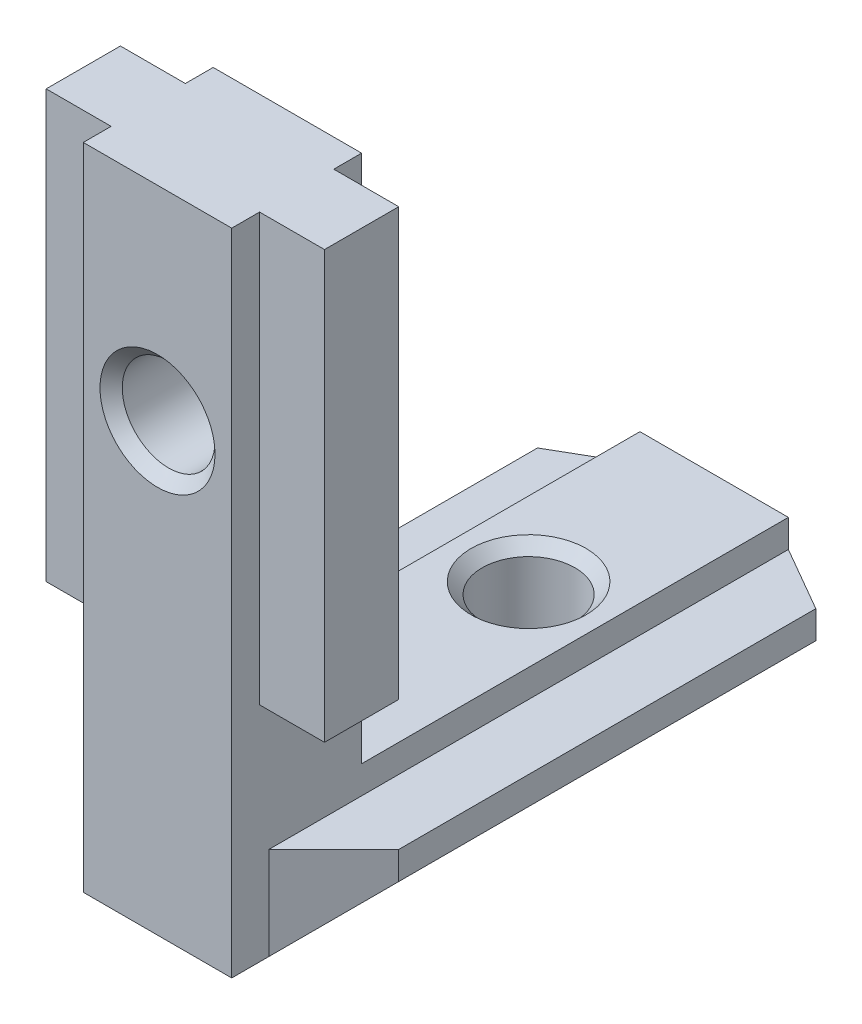
ISO-10303-21;
HEADER;
FILE_DESCRIPTION(('STEP AP214'),'2;1');
FILE_NAME('part.step','',(''),(''),'','','');
FILE_SCHEMA(('AUTOMOTIVE_DESIGN { 1 0 10303 214 1 1 1 1 }'));
ENDSEC;
DATA;
#1=APPLICATION_CONTEXT('core data for automotive mechanical design processes');
#2=APPLICATION_PROTOCOL_DEFINITION('international standard','automotive_design',2000,#1);
#3=PRODUCT_CONTEXT('',#1,'mechanical');
#4=PRODUCT('Part','Part','',(#3));
#5=PRODUCT_RELATED_PRODUCT_CATEGORY('part','',(#4));
#6=PRODUCT_DEFINITION_FORMATION('','',#4);
#7=PRODUCT_DEFINITION_CONTEXT('part definition',#1,'design');
#8=PRODUCT_DEFINITION('design','',#6,#7);
#9=PRODUCT_DEFINITION_SHAPE('','',#8);
#10=(LENGTH_UNIT() NAMED_UNIT(*) SI_UNIT(.MILLI.,.METRE.));
#11=(NAMED_UNIT(*) PLANE_ANGLE_UNIT() SI_UNIT($,.RADIAN.));
#12=(NAMED_UNIT(*) SI_UNIT($,.STERADIAN.) SOLID_ANGLE_UNIT());
#13=UNCERTAINTY_MEASURE_WITH_UNIT(LENGTH_MEASURE(1.E-05),#10,'distance_accuracy_value','');
#14=(GEOMETRIC_REPRESENTATION_CONTEXT(3) GLOBAL_UNCERTAINTY_ASSIGNED_CONTEXT((#13)) GLOBAL_UNIT_ASSIGNED_CONTEXT((#10,
#11,#12)) REPRESENTATION_CONTEXT('',''));
#15=CARTESIAN_POINT('',(0.,0.,0.));
#16=DIRECTION('',(0.,0.,1.));
#17=DIRECTION('',(1.,0.,0.));
#18=AXIS2_PLACEMENT_3D('',#15,#16,#17);
#19=CARTESIAN_POINT('',(4.,0.,30.));
#20=DIRECTION('',(0.,-1.,0.));
#21=DIRECTION('',(0.,0.,-1.));
#22=AXIS2_PLACEMENT_3D('',#19,#20,#21);
#23=PLANE('',#22);
#24=CARTESIAN_POINT('',(0.,0.,10.));
#25=DIRECTION('',(0.,-1.,0.));
#26=DIRECTION('',(0.,0.,-1.));
#27=AXIS2_PLACEMENT_3D('',#24,#25,#26);
#28=CIRCLE('',#27,3.1);
#29=CARTESIAN_POINT('',(0.,0.,6.9));
#30=VERTEX_POINT('',#29);
#31=EDGE_CURVE('E672',#30,#30,#28,.T.);
#32=ORIENTED_EDGE('',*,*,#31,.T.);
#33=EDGE_LOOP('',(#32));
#34=FACE_BOUND('',#33,.T.);
#35=DIRECTION('',(-1.,0.,0.));
#36=VECTOR('',#35,1.);
#37=CARTESIAN_POINT('',(4.,0.,23.));
#38=LINE('',#37,#36);
#39=CARTESIAN_POINT('',(4.,0.,23.));
#40=VERTEX_POINT('',#39);
#41=CARTESIAN_POINT('',(-4.,0.,23.));
#42=VERTEX_POINT('',#41);
#43=EDGE_CURVE('E341',#40,#42,#38,.T.);
#44=ORIENTED_EDGE('',*,*,#43,.F.);
#45=DIRECTION('',(0.,0.,-1.));
#46=VECTOR('',#45,1.);
#47=CARTESIAN_POINT('',(4.,0.,30.));
#48=LINE('',#47,#46);
#49=CARTESIAN_POINT('',(4.,0.,0.));
#50=VERTEX_POINT('',#49);
#51=EDGE_CURVE('E313',#40,#50,#48,.T.);
#52=ORIENTED_EDGE('',*,*,#51,.T.);
#53=DIRECTION('',(-1.,0.,0.));
#54=VECTOR('',#53,1.);
#55=CARTESIAN_POINT('',(4.,0.,0.));
#56=LINE('',#55,#54);
#57=CARTESIAN_POINT('',(-4.,0.,0.));
#58=VERTEX_POINT('',#57);
#59=EDGE_CURVE('E295',#50,#58,#56,.T.);
#60=ORIENTED_EDGE('',*,*,#59,.T.);
#61=DIRECTION('',(0.,0.,-1.));
#62=VECTOR('',#61,1.);
#63=CARTESIAN_POINT('',(-4.,0.,30.));
#64=LINE('',#63,#62);
#65=EDGE_CURVE('E301',#42,#58,#64,.T.);
#66=ORIENTED_EDGE('',*,*,#65,.F.);
#67=EDGE_LOOP('',(#44,#52,#60,#66));
#68=FACE_BOUND('',#67,.T.);
#69=ADVANCED_FACE('F36',(#34,#68),#23,.F.);
#70=CARTESIAN_POINT('',(-4.,0.,30.));
#71=DIRECTION('',(1.,0.,0.));
#72=DIRECTION('',(0.,0.,-1.));
#73=AXIS2_PLACEMENT_3D('',#70,#71,#72);
#74=PLANE('',#73);
#75=DIRECTION('',(0.,0.,1.));
#76=VECTOR('',#75,1.);
#77=CARTESIAN_POINT('',(-4.,28.5,30.));
#78=LINE('',#77,#76);
#79=CARTESIAN_POINT('',(-4.,28.5,28.5));
#80=VERTEX_POINT('',#79);
#81=CARTESIAN_POINT('',(-4.,28.5,30.));
#82=VERTEX_POINT('',#81);
#83=EDGE_CURVE('E283',#80,#82,#78,.T.);
#84=ORIENTED_EDGE('',*,*,#83,.F.);
#85=DIRECTION('',(0.,-1.,0.));
#86=VECTOR('',#85,1.);
#87=CARTESIAN_POINT('',(-4.,0.,28.5));
#88=LINE('',#87,#86);
#89=CARTESIAN_POINT('',(-4.,5.50000000000001,28.5));
#90=VERTEX_POINT('',#89);
#91=EDGE_CURVE('E232',#80,#90,#88,.T.);
#92=ORIENTED_EDGE('',*,*,#91,.T.);
#93=DIRECTION('',(0.,0.,1.));
#94=VECTOR('',#93,1.);
#95=CARTESIAN_POINT('',(-4.,5.50000000000001,30.));
#96=LINE('',#95,#94);
#97=CARTESIAN_POINT('',(-4.,5.50000000000001,24.5));
#98=VERTEX_POINT('',#97);
#99=EDGE_CURVE('E235',#98,#90,#96,.T.);
#100=ORIENTED_EDGE('',*,*,#99,.F.);
#101=DIRECTION('',(0.,1.,0.));
#102=VECTOR('',#101,1.);
#103=CARTESIAN_POINT('',(-4.,0.,24.5));
#104=LINE('',#103,#102);
#105=CARTESIAN_POINT('',(-4.,28.5,24.5));
#106=VERTEX_POINT('',#105);
#107=EDGE_CURVE('E227',#98,#106,#104,.T.);
#108=ORIENTED_EDGE('',*,*,#107,.T.);
#109=CARTESIAN_POINT('',(-4.,28.5,23.));
#110=VERTEX_POINT('',#109);
#111=EDGE_CURVE('E278',#110,#106,#78,.T.);
#112=ORIENTED_EDGE('',*,*,#111,.F.);
#113=DIRECTION('',(0.,1.,0.));
#114=VECTOR('',#113,1.);
#115=CARTESIAN_POINT('',(-4.,28.5,23.));
#116=LINE('',#115,#114);
#117=EDGE_CURVE('E274',#42,#110,#116,.T.);
#118=ORIENTED_EDGE('',*,*,#117,.F.);
#119=ORIENTED_EDGE('',*,*,#65,.T.);
#120=DIRECTION('',(0.,-1.,0.));
#121=VECTOR('',#120,1.);
#122=CARTESIAN_POINT('',(-4.,0.,0.));
#123=LINE('',#122,#121);
#124=CARTESIAN_POINT('',(-4.,-1.5,0.));
#125=VERTEX_POINT('',#124);
#126=EDGE_CURVE('E291',#58,#125,#123,.T.);
#127=ORIENTED_EDGE('',*,*,#126,.T.);
#128=DIRECTION('',(0.,0.,-1.));
#129=VECTOR('',#128,1.);
#130=CARTESIAN_POINT('',(-4.,-1.5,30.));
#131=LINE('',#130,#129);
#132=CARTESIAN_POINT('',(-4.,-1.5,28.));
#133=VERTEX_POINT('',#132);
#134=EDGE_CURVE('E338',#133,#125,#131,.T.);
#135=ORIENTED_EDGE('',*,*,#134,.F.);
#136=DIRECTION('',(0.,1.,0.));
#137=VECTOR('',#136,1.);
#138=CARTESIAN_POINT('',(-4.,-6.5,28.));
#139=LINE('',#138,#137);
#140=CARTESIAN_POINT('',(-4.,-6.5,28.));
#141=VERTEX_POINT('',#140);
#142=EDGE_CURVE('E240',#141,#133,#139,.T.);
#143=ORIENTED_EDGE('',*,*,#142,.F.);
#144=DIRECTION('',(0.,0.,-1.));
#145=VECTOR('',#144,1.);
#146=CARTESIAN_POINT('',(-4.,-6.5,30.));
#147=LINE('',#146,#145);
#148=CARTESIAN_POINT('',(-4.,-6.5,30.));
#149=VERTEX_POINT('',#148);
#150=EDGE_CURVE('E329',#149,#141,#147,.T.);
#151=ORIENTED_EDGE('',*,*,#150,.F.);
#152=DIRECTION('',(0.,-1.,0.));
#153=VECTOR('',#152,1.);
#154=CARTESIAN_POINT('',(-4.,0.,30.));
#155=LINE('',#154,#153);
#156=EDGE_CURVE('E292',#82,#149,#155,.T.);
#157=ORIENTED_EDGE('',*,*,#156,.F.);
#158=EDGE_LOOP('',(#84,#92,#100,#108,#112,#118,#119,#127,#135,#143,#151,#157));
#159=FACE_BOUND('',#158,.T.);
#160=ADVANCED_FACE('F38',(#159),#74,.F.);
#161=CARTESIAN_POINT('',(-4.,-1.5,30.));
#162=DIRECTION('',(0.,-1.,0.));
#163=DIRECTION('',(1.,0.,0.));
#164=AXIS2_PLACEMENT_3D('',#161,#162,#163);
#165=PLANE('',#164);
#166=DIRECTION('',(0.,0.,-1.));
#167=VECTOR('',#166,1.);
#168=CARTESIAN_POINT('',(-7.5,-1.5,30.));
#169=LINE('',#168,#167);
#170=CARTESIAN_POINT('',(-7.5,-1.5,24.5));
#171=VERTEX_POINT('',#170);
#172=CARTESIAN_POINT('',(-7.5,-1.5,2.02072594216366));
#173=VERTEX_POINT('',#172);
#174=EDGE_CURVE('E335',#171,#173,#169,.T.);
#175=ORIENTED_EDGE('',*,*,#174,.F.);
#176=DIRECTION('',(-0.707106781186549,0.,-0.707106781186546));
#177=VECTOR('',#176,1.);
#178=CARTESIAN_POINT('',(-4.,-1.5,28.));
#179=LINE('',#178,#177);
#180=EDGE_CURVE('E238',#133,#171,#179,.T.);
#181=ORIENTED_EDGE('',*,*,#180,.F.);
#182=ORIENTED_EDGE('',*,*,#134,.T.);
#183=DIRECTION('',(0.866025403784442,0.,-0.499999999999995));
#184=VECTOR('',#183,1.);
#185=CARTESIAN_POINT('',(-4.,-1.5,0.));
#186=LINE('',#185,#184);
#187=EDGE_CURVE('E245',#173,#125,#186,.T.);
#188=ORIENTED_EDGE('',*,*,#187,.F.);
#189=EDGE_LOOP('',(#175,#181,#182,#188));
#190=FACE_BOUND('',#189,.T.);
#191=ADVANCED_FACE('F359',(#190),#165,.F.);
#192=CARTESIAN_POINT('',(-7.5,-1.5,30.));
#193=DIRECTION('',(1.,0.,0.));
#194=DIRECTION('',(0.,0.,-1.));
#195=AXIS2_PLACEMENT_3D('',#192,#193,#194);
#196=PLANE('',#195);
#197=DIRECTION('',(0.,0.,-1.));
#198=VECTOR('',#197,1.);
#199=CARTESIAN_POINT('',(-7.5,-3.,30.));
#200=LINE('',#199,#198);
#201=CARTESIAN_POINT('',(-7.5,-3.,24.5));
#202=VERTEX_POINT('',#201);
#203=CARTESIAN_POINT('',(-7.5,-3.,2.02072594216366));
#204=VERTEX_POINT('',#203);
#205=EDGE_CURVE('E332',#202,#204,#200,.T.);
#206=ORIENTED_EDGE('',*,*,#205,.F.);
#207=DIRECTION('',(0.,1.,0.));
#208=VECTOR('',#207,1.);
#209=CARTESIAN_POINT('',(-7.5,-6.5,24.5));
#210=LINE('',#209,#208);
#211=EDGE_CURVE('E242',#202,#171,#210,.T.);
#212=ORIENTED_EDGE('',*,*,#211,.T.);
#213=ORIENTED_EDGE('',*,*,#174,.T.);
#214=DIRECTION('',(0.,1.,0.));
#215=VECTOR('',#214,1.);
#216=CARTESIAN_POINT('',(-7.5,-6.5,2.02072594216366));
#217=LINE('',#216,#215);
#218=EDGE_CURVE('E260',#204,#173,#217,.T.);
#219=ORIENTED_EDGE('',*,*,#218,.F.);
#220=EDGE_LOOP('',(#206,#212,#213,#219));
#221=FACE_BOUND('',#220,.T.);
#222=ADVANCED_FACE('F353',(#221),#196,.F.);
#223=CARTESIAN_POINT('',(-7.5,-3.,30.));
#224=DIRECTION('',(0.707106781186547,0.707106781186548,0.));
#225=DIRECTION('',(-0.707106781186548,0.707106781186547,0.));
#226=AXIS2_PLACEMENT_3D('',#223,#224,#225);
#227=PLANE('',#226);
#228=CARTESIAN_POINT('',(-4.,-6.5,0.));
#229=VERTEX_POINT('',#228);
#230=EDGE_CURVE('E328',#141,#229,#147,.T.);
#231=ORIENTED_EDGE('',*,*,#230,.F.);
#232=DIRECTION('',(-0.577350269189627,0.577350269189626,-0.577350269189624));
#233=VECTOR('',#232,1.);
#234=CARTESIAN_POINT('',(-5.66666666666667,-4.83333333333333,26.3333333333333));
#235=LINE('',#234,#233);
#236=EDGE_CURVE('E44',#141,#202,#235,.T.);
#237=ORIENTED_EDGE('',*,*,#236,.T.);
#238=ORIENTED_EDGE('',*,*,#205,.T.);
#239=DIRECTION('',(0.654653670707979,-0.654653670707978,-0.377964473009223));
#240=VECTOR('',#239,1.);
#241=CARTESIAN_POINT('',(-14.4230748895808,3.92307488958084,6.01776509328304));
#242=LINE('',#241,#240);
#243=EDGE_CURVE('E264',#204,#229,#242,.T.);
#244=ORIENTED_EDGE('',*,*,#243,.T.);
#245=EDGE_LOOP('',(#231,#237,#238,#244));
#246=FACE_BOUND('',#245,.T.);
#247=ADVANCED_FACE('F347',(#246),#227,.F.);
#248=CARTESIAN_POINT('',(-4.,-6.5,30.));
#249=DIRECTION('',(0.,1.,0.));
#250=DIRECTION('',(0.,0.,1.));
#251=AXIS2_PLACEMENT_3D('',#248,#249,#250);
#252=PLANE('',#251);
#253=CARTESIAN_POINT('',(0.,-6.5,10.));
#254=DIRECTION('',(0.,-1.,0.));
#255=DIRECTION('',(0.,0.,-1.));
#256=AXIS2_PLACEMENT_3D('',#253,#254,#255);
#257=CIRCLE('',#256,3.1);
#258=CARTESIAN_POINT('',(0.,-6.5,6.9));
#259=VERTEX_POINT('',#258);
#260=EDGE_CURVE('E674',#259,#259,#257,.T.);
#261=ORIENTED_EDGE('',*,*,#260,.F.);
#262=EDGE_LOOP('',(#261));
#263=FACE_BOUND('',#262,.T.);
#264=ORIENTED_EDGE('',*,*,#150,.T.);
#265=ORIENTED_EDGE('',*,*,#230,.T.);
#266=DIRECTION('',(1.,0.,0.));
#267=VECTOR('',#266,1.);
#268=CARTESIAN_POINT('',(-4.,-6.5,0.));
#269=LINE('',#268,#267);
#270=CARTESIAN_POINT('',(4.,-6.5,0.));
#271=VERTEX_POINT('',#270);
#272=EDGE_CURVE('E304',#229,#271,#269,.T.);
#273=ORIENTED_EDGE('',*,*,#272,.T.);
#274=DIRECTION('',(0.,0.,-1.));
#275=VECTOR('',#274,1.);
#276=CARTESIAN_POINT('',(4.,-6.5,30.));
#277=LINE('',#276,#275);
#278=CARTESIAN_POINT('',(4.,-6.5,28.));
#279=VERTEX_POINT('',#278);
#280=EDGE_CURVE('E324',#279,#271,#277,.T.);
#281=ORIENTED_EDGE('',*,*,#280,.F.);
#282=CARTESIAN_POINT('',(4.,-6.5,30.));
#283=VERTEX_POINT('',#282);
#284=EDGE_CURVE('E325',#283,#279,#277,.T.);
#285=ORIENTED_EDGE('',*,*,#284,.F.);
#286=DIRECTION('',(1.,0.,0.));
#287=VECTOR('',#286,1.);
#288=CARTESIAN_POINT('',(-4.,-6.5,30.));
#289=LINE('',#288,#287);
#290=EDGE_CURVE('E294',#149,#283,#289,.T.);
#291=ORIENTED_EDGE('',*,*,#290,.F.);
#292=EDGE_LOOP('',(#264,#265,#273,#281,#285,#291));
#293=FACE_BOUND('',#292,.T.);
#294=ADVANCED_FACE('F395',(#263,#293),#252,.F.);
#295=CARTESIAN_POINT('',(7.5,-3.,30.));
#296=DIRECTION('',(-0.707106781186547,0.707106781186548,0.));
#297=DIRECTION('',(-0.707106781186548,-0.707106781186547,0.));
#298=AXIS2_PLACEMENT_3D('',#295,#296,#297);
#299=PLANE('',#298);
#300=ORIENTED_EDGE('',*,*,#280,.T.);
#301=DIRECTION('',(0.654653670707979,0.654653670707979,0.377964473009222));
#302=VECTOR('',#301,1.);
#303=CARTESIAN_POINT('',(14.4230748895808,3.92307488958083,6.01776509328303));
#304=LINE('',#303,#302);
#305=CARTESIAN_POINT('',(7.5,-3.,2.02072594216366));
#306=VERTEX_POINT('',#305);
#307=EDGE_CURVE('E268',#271,#306,#304,.T.);
#308=ORIENTED_EDGE('',*,*,#307,.T.);
#309=DIRECTION('',(0.,0.,-1.));
#310=VECTOR('',#309,1.);
#311=CARTESIAN_POINT('',(7.5,-3.,30.));
#312=LINE('',#311,#310);
#313=CARTESIAN_POINT('',(7.50000000000001,-3.,24.5));
#314=VERTEX_POINT('',#313);
#315=EDGE_CURVE('E321',#314,#306,#312,.T.);
#316=ORIENTED_EDGE('',*,*,#315,.F.);
#317=DIRECTION('',(-0.577350269189627,-0.577350269189627,0.577350269189624));
#318=VECTOR('',#317,1.);
#319=CARTESIAN_POINT('',(5.66666666666667,-4.83333333333333,26.3333333333333));
#320=LINE('',#319,#318);
#321=EDGE_CURVE('E271',#314,#279,#320,.T.);
#322=ORIENTED_EDGE('',*,*,#321,.T.);
#323=EDGE_LOOP('',(#300,#308,#316,#322));
#324=FACE_BOUND('',#323,.T.);
#325=ADVANCED_FACE('F391',(#324),#299,.F.);
#326=CARTESIAN_POINT('',(7.5,-1.5,30.));
#327=DIRECTION('',(-1.,0.,0.));
#328=DIRECTION('',(0.,0.,1.));
#329=AXIS2_PLACEMENT_3D('',#326,#327,#328);
#330=PLANE('',#329);
#331=ORIENTED_EDGE('',*,*,#315,.T.);
#332=DIRECTION('',(0.,1.,0.));
#333=VECTOR('',#332,1.);
#334=CARTESIAN_POINT('',(7.5,-6.5,2.02072594216366));
#335=LINE('',#334,#333);
#336=CARTESIAN_POINT('',(7.5,-1.5,2.02072594216366));
#337=VERTEX_POINT('',#336);
#338=EDGE_CURVE('E251',#306,#337,#335,.T.);
#339=ORIENTED_EDGE('',*,*,#338,.T.);
#340=DIRECTION('',(0.,0.,-1.));
#341=VECTOR('',#340,1.);
#342=CARTESIAN_POINT('',(7.5,-1.5,30.));
#343=LINE('',#342,#341);
#344=CARTESIAN_POINT('',(7.50000000000001,-1.5,24.5));
#345=VERTEX_POINT('',#344);
#346=EDGE_CURVE('E318',#345,#337,#343,.T.);
#347=ORIENTED_EDGE('',*,*,#346,.F.);
#348=DIRECTION('',(0.,1.,0.));
#349=VECTOR('',#348,1.);
#350=CARTESIAN_POINT('',(7.50000000000001,-6.5,24.5));
#351=LINE('',#350,#349);
#352=EDGE_CURVE('E250',#314,#345,#351,.T.);
#353=ORIENTED_EDGE('',*,*,#352,.F.);
#354=EDGE_LOOP('',(#331,#339,#347,#353));
#355=FACE_BOUND('',#354,.T.);
#356=ADVANCED_FACE('F386',(#355),#330,.F.);
#357=CARTESIAN_POINT('',(4.,-1.5,30.));
#358=DIRECTION('',(0.,-1.,0.));
#359=DIRECTION('',(1.,0.,0.));
#360=AXIS2_PLACEMENT_3D('',#357,#358,#359);
#361=PLANE('',#360);
#362=ORIENTED_EDGE('',*,*,#346,.T.);
#363=DIRECTION('',(0.866025403784442,0.,0.499999999999994));
#364=VECTOR('',#363,1.);
#365=CARTESIAN_POINT('',(4.,-1.5,0.));
#366=LINE('',#365,#364);
#367=CARTESIAN_POINT('',(4.,-1.5,0.));
#368=VERTEX_POINT('',#367);
#369=EDGE_CURVE('E237',#368,#337,#366,.T.);
#370=ORIENTED_EDGE('',*,*,#369,.F.);
#371=DIRECTION('',(0.,0.,-1.));
#372=VECTOR('',#371,1.);
#373=CARTESIAN_POINT('',(4.,-1.5,30.));
#374=LINE('',#373,#372);
#375=CARTESIAN_POINT('',(4.,-1.5,28.));
#376=VERTEX_POINT('',#375);
#377=EDGE_CURVE('E315',#376,#368,#374,.T.);
#378=ORIENTED_EDGE('',*,*,#377,.F.);
#379=DIRECTION('',(-0.707106781186549,0.,0.707106781186545));
#380=VECTOR('',#379,1.);
#381=CARTESIAN_POINT('',(4.,-1.5,28.));
#382=LINE('',#381,#380);
#383=EDGE_CURVE('E247',#345,#376,#382,.T.);
#384=ORIENTED_EDGE('',*,*,#383,.F.);
#385=EDGE_LOOP('',(#362,#370,#378,#384));
#386=FACE_BOUND('',#385,.T.);
#387=ADVANCED_FACE('F381',(#386),#361,.F.);
#388=CARTESIAN_POINT('',(4.,0.,30.));
#389=DIRECTION('',(-1.,0.,0.));
#390=DIRECTION('',(0.,0.,1.));
#391=AXIS2_PLACEMENT_3D('',#388,#389,#390);
#392=PLANE('',#391);
#393=DIRECTION('',(0.,0.,-1.));
#394=VECTOR('',#393,1.);
#395=CARTESIAN_POINT('',(4.,5.50000000000001,30.));
#396=LINE('',#395,#394);
#397=CARTESIAN_POINT('',(4.,5.50000000000001,28.5));
#398=VERTEX_POINT('',#397);
#399=CARTESIAN_POINT('',(4.,5.50000000000001,24.5));
#400=VERTEX_POINT('',#399);
#401=EDGE_CURVE('E11',#398,#400,#396,.T.);
#402=ORIENTED_EDGE('',*,*,#401,.F.);
#403=DIRECTION('',(0.,1.,0.));
#404=VECTOR('',#403,1.);
#405=CARTESIAN_POINT('',(4.,0.,28.5));
#406=LINE('',#405,#404);
#407=CARTESIAN_POINT('',(4.,28.5,28.5));
#408=VERTEX_POINT('',#407);
#409=EDGE_CURVE('E230',#398,#408,#406,.T.);
#410=ORIENTED_EDGE('',*,*,#409,.T.);
#411=DIRECTION('',(0.,0.,1.));
#412=VECTOR('',#411,1.);
#413=CARTESIAN_POINT('',(4.,28.5,30.));
#414=LINE('',#413,#412);
#415=CARTESIAN_POINT('',(4.,28.5,30.));
#416=VERTEX_POINT('',#415);
#417=EDGE_CURVE('E277',#408,#416,#414,.T.);
#418=ORIENTED_EDGE('',*,*,#417,.T.);
#419=DIRECTION('',(0.,1.,0.));
#420=VECTOR('',#419,1.);
#421=CARTESIAN_POINT('',(4.,0.,30.));
#422=LINE('',#421,#420);
#423=EDGE_CURVE('E298',#283,#416,#422,.T.);
#424=ORIENTED_EDGE('',*,*,#423,.F.);
#425=ORIENTED_EDGE('',*,*,#284,.T.);
#426=DIRECTION('',(0.,1.,0.));
#427=VECTOR('',#426,1.);
#428=CARTESIAN_POINT('',(4.,-6.5,28.));
#429=LINE('',#428,#427);
#430=EDGE_CURVE('E241',#279,#376,#429,.T.);
#431=ORIENTED_EDGE('',*,*,#430,.T.);
#432=ORIENTED_EDGE('',*,*,#377,.T.);
#433=DIRECTION('',(0.,1.,0.));
#434=VECTOR('',#433,1.);
#435=CARTESIAN_POINT('',(4.,0.,0.));
#436=LINE('',#435,#434);
#437=EDGE_CURVE('E307',#368,#50,#436,.T.);
#438=ORIENTED_EDGE('',*,*,#437,.T.);
#439=ORIENTED_EDGE('',*,*,#51,.F.);
#440=DIRECTION('',(0.,1.,0.));
#441=VECTOR('',#440,1.);
#442=CARTESIAN_POINT('',(4.,28.5,23.));
#443=LINE('',#442,#441);
#444=CARTESIAN_POINT('',(4.,28.5,23.));
#445=VERTEX_POINT('',#444);
#446=EDGE_CURVE('E275',#40,#445,#443,.T.);
#447=ORIENTED_EDGE('',*,*,#446,.T.);
#448=CARTESIAN_POINT('',(4.,28.5,24.5));
#449=VERTEX_POINT('',#448);
#450=EDGE_CURVE('E279',#445,#449,#414,.T.);
#451=ORIENTED_EDGE('',*,*,#450,.T.);
#452=DIRECTION('',(0.,-1.,0.));
#453=VECTOR('',#452,1.);
#454=CARTESIAN_POINT('',(4.,0.,24.5));
#455=LINE('',#454,#453);
#456=EDGE_CURVE('E51',#449,#400,#455,.T.);
#457=ORIENTED_EDGE('',*,*,#456,.T.);
#458=EDGE_LOOP('',(#402,#410,#418,#424,#425,#431,#432,#438,#439,#447,#451,#457));
#459=FACE_BOUND('',#458,.T.);
#460=ADVANCED_FACE('F376',(#459),#392,.F.);
#461=CARTESIAN_POINT('',(0.,0.,30.));
#462=DIRECTION('',(0.,0.,-1.));
#463=DIRECTION('',(-1.,0.,0.));
#464=AXIS2_PLACEMENT_3D('',#461,#462,#463);
#465=PLANE('',#464);
#466=CARTESIAN_POINT('',(0.,17.5,30.));
#467=DIRECTION('',(0.,0.,1.));
#468=DIRECTION('',(1.,0.,0.));
#469=AXIS2_PLACEMENT_3D('',#466,#467,#468);
#470=CIRCLE('',#469,3.1);
#471=CARTESIAN_POINT('',(3.1,17.5,30.));
#472=VERTEX_POINT('',#471);
#473=EDGE_CURVE('E662',#472,#472,#470,.T.);
#474=ORIENTED_EDGE('',*,*,#473,.F.);
#475=EDGE_LOOP('',(#474));
#476=FACE_BOUND('',#475,.T.);
#477=ORIENTED_EDGE('',*,*,#290,.T.);
#478=ORIENTED_EDGE('',*,*,#423,.T.);
#479=DIRECTION('',(-1.,0.,0.));
#480=VECTOR('',#479,1.);
#481=CARTESIAN_POINT('',(4.,28.5,30.));
#482=LINE('',#481,#480);
#483=EDGE_CURVE('E281',#416,#82,#482,.T.);
#484=ORIENTED_EDGE('',*,*,#483,.T.);
#485=ORIENTED_EDGE('',*,*,#156,.T.);
#486=EDGE_LOOP('',(#477,#478,#484,#485));
#487=FACE_BOUND('',#486,.T.);
#488=ADVANCED_FACE('F423',(#476,#487),#465,.F.);
#489=CARTESIAN_POINT('',(0.,0.,0.));
#490=DIRECTION('',(0.,0.,-1.));
#491=DIRECTION('',(-1.,0.,0.));
#492=AXIS2_PLACEMENT_3D('',#489,#490,#491);
#493=PLANE('',#492);
#494=DIRECTION('',(0.,1.,0.));
#495=VECTOR('',#494,1.);
#496=CARTESIAN_POINT('',(4.,-6.5,0.));
#497=LINE('',#496,#495);
#498=EDGE_CURVE('E255',#271,#368,#497,.T.);
#499=ORIENTED_EDGE('',*,*,#498,.F.);
#500=ORIENTED_EDGE('',*,*,#272,.F.);
#501=DIRECTION('',(0.,1.,0.));
#502=VECTOR('',#501,1.);
#503=CARTESIAN_POINT('',(-4.,-6.5,0.));
#504=LINE('',#503,#502);
#505=EDGE_CURVE('E261',#229,#125,#504,.T.);
#506=ORIENTED_EDGE('',*,*,#505,.T.);
#507=ORIENTED_EDGE('',*,*,#126,.F.);
#508=ORIENTED_EDGE('',*,*,#59,.F.);
#509=ORIENTED_EDGE('',*,*,#437,.F.);
#510=EDGE_LOOP('',(#499,#500,#506,#507,#508,#509));
#511=FACE_BOUND('',#510,.T.);
#512=ADVANCED_FACE('F367',(#511),#493,.T.);
#513=CARTESIAN_POINT('',(4.,28.5,23.));
#514=DIRECTION('',(0.,0.,1.));
#515=DIRECTION('',(0.,-1.,0.));
#516=AXIS2_PLACEMENT_3D('',#513,#514,#515);
#517=PLANE('',#516);
#518=CARTESIAN_POINT('',(0.,17.5,23.));
#519=DIRECTION('',(0.,0.,1.));
#520=DIRECTION('',(1.,0.,0.));
#521=AXIS2_PLACEMENT_3D('',#518,#519,#520);
#522=CIRCLE('',#521,3.1);
#523=CARTESIAN_POINT('',(3.1,17.5,23.));
#524=VERTEX_POINT('',#523);
#525=EDGE_CURVE('E663',#524,#524,#522,.T.);
#526=ORIENTED_EDGE('',*,*,#525,.T.);
#527=EDGE_LOOP('',(#526));
#528=FACE_BOUND('',#527,.T.);
#529=ORIENTED_EDGE('',*,*,#446,.F.);
#530=ORIENTED_EDGE('',*,*,#43,.T.);
#531=ORIENTED_EDGE('',*,*,#117,.T.);
#532=DIRECTION('',(-1.,0.,0.));
#533=VECTOR('',#532,1.);
#534=CARTESIAN_POINT('',(4.,28.5,23.));
#535=LINE('',#534,#533);
#536=EDGE_CURVE('E288',#445,#110,#535,.T.);
#537=ORIENTED_EDGE('',*,*,#536,.F.);
#538=EDGE_LOOP('',(#529,#530,#531,#537));
#539=FACE_BOUND('',#538,.T.);
#540=ADVANCED_FACE('F485',(#528,#539),#517,.F.);
#541=CARTESIAN_POINT('',(4.,28.5,30.));
#542=DIRECTION('',(0.,-1.,0.));
#543=DIRECTION('',(0.,0.,-1.));
#544=AXIS2_PLACEMENT_3D('',#541,#542,#543);
#545=PLANE('',#544);
#546=ORIENTED_EDGE('',*,*,#111,.T.);
#547=DIRECTION('',(-1.,0.,0.));
#548=VECTOR('',#547,1.);
#549=CARTESIAN_POINT('',(-7.5,28.5,24.5));
#550=LINE('',#549,#548);
#551=CARTESIAN_POINT('',(-7.5,28.5,24.5));
#552=VERTEX_POINT('',#551);
#553=EDGE_CURVE('E216',#106,#552,#550,.T.);
#554=ORIENTED_EDGE('',*,*,#553,.T.);
#555=DIRECTION('',(0.,0.,1.));
#556=VECTOR('',#555,1.);
#557=CARTESIAN_POINT('',(-7.5,28.5,24.5));
#558=LINE('',#557,#556);
#559=CARTESIAN_POINT('',(-7.5,28.5,28.5));
#560=VERTEX_POINT('',#559);
#561=EDGE_CURVE('E218',#552,#560,#558,.T.);
#562=ORIENTED_EDGE('',*,*,#561,.T.);
#563=DIRECTION('',(1.,0.,0.));
#564=VECTOR('',#563,1.);
#565=CARTESIAN_POINT('',(-7.5,28.5,28.5));
#566=LINE('',#565,#564);
#567=EDGE_CURVE('E201',#560,#80,#566,.T.);
#568=ORIENTED_EDGE('',*,*,#567,.T.);
#569=ORIENTED_EDGE('',*,*,#83,.T.);
#570=ORIENTED_EDGE('',*,*,#483,.F.);
#571=ORIENTED_EDGE('',*,*,#417,.F.);
#572=CARTESIAN_POINT('',(7.5,28.5,28.5));
#573=VERTEX_POINT('',#572);
#574=EDGE_CURVE('E203',#408,#573,#566,.T.);
#575=ORIENTED_EDGE('',*,*,#574,.T.);
#576=DIRECTION('',(0.,0.,-1.));
#577=VECTOR('',#576,1.);
#578=CARTESIAN_POINT('',(7.5,28.5,24.5));
#579=LINE('',#578,#577);
#580=CARTESIAN_POINT('',(7.5,28.5,24.5));
#581=VERTEX_POINT('',#580);
#582=EDGE_CURVE('E214',#573,#581,#579,.T.);
#583=ORIENTED_EDGE('',*,*,#582,.T.);
#584=EDGE_CURVE('E181',#581,#449,#550,.T.);
#585=ORIENTED_EDGE('',*,*,#584,.T.);
#586=ORIENTED_EDGE('',*,*,#450,.F.);
#587=ORIENTED_EDGE('',*,*,#536,.T.);
#588=EDGE_LOOP('',(#546,#554,#562,#568,#569,#570,#571,#575,#583,#585,#586,#587));
#589=FACE_BOUND('',#588,.T.);
#590=ADVANCED_FACE('F491',(#589),#545,.F.);
#591=CARTESIAN_POINT('',(-4.,-6.5,0.));
#592=DIRECTION('',(0.499999999999995,0.,0.866025403784442));
#593=DIRECTION('',(0.866025403784442,0.,-0.499999999999995));
#594=AXIS2_PLACEMENT_3D('',#591,#592,#593);
#595=PLANE('',#594);
#596=ORIENTED_EDGE('',*,*,#218,.T.);
#597=ORIENTED_EDGE('',*,*,#187,.T.);
#598=ORIENTED_EDGE('',*,*,#505,.F.);
#599=ORIENTED_EDGE('',*,*,#243,.F.);
#600=EDGE_LOOP('',(#596,#597,#598,#599));
#601=FACE_BOUND('',#600,.T.);
#602=ADVANCED_FACE('F357',(#601),#595,.F.);
#603=CARTESIAN_POINT('',(4.,-6.5,0.));
#604=DIRECTION('',(-0.499999999999994,0.,0.866025403784442));
#605=DIRECTION('',(0.866025403784442,0.,0.499999999999994));
#606=AXIS2_PLACEMENT_3D('',#603,#604,#605);
#607=PLANE('',#606);
#608=ORIENTED_EDGE('',*,*,#498,.T.);
#609=ORIENTED_EDGE('',*,*,#369,.T.);
#610=ORIENTED_EDGE('',*,*,#338,.F.);
#611=ORIENTED_EDGE('',*,*,#307,.F.);
#612=EDGE_LOOP('',(#608,#609,#610,#611));
#613=FACE_BOUND('',#612,.T.);
#614=ADVANCED_FACE('F384',(#613),#607,.F.);
#615=CARTESIAN_POINT('',(-4.,-6.5,28.));
#616=DIRECTION('',(0.707106781186546,0.,-0.707106781186549));
#617=DIRECTION('',(-0.707106781186549,0.,-0.707106781186546));
#618=AXIS2_PLACEMENT_3D('',#615,#616,#617);
#619=PLANE('',#618);
#620=ORIENTED_EDGE('',*,*,#142,.T.);
#621=ORIENTED_EDGE('',*,*,#180,.T.);
#622=ORIENTED_EDGE('',*,*,#211,.F.);
#623=ORIENTED_EDGE('',*,*,#236,.F.);
#624=EDGE_LOOP('',(#620,#621,#622,#623));
#625=FACE_BOUND('',#624,.T.);
#626=ADVANCED_FACE('F399',(#625),#619,.F.);
#627=CARTESIAN_POINT('',(4.,-6.5,28.));
#628=DIRECTION('',(-0.707106781186546,0.,-0.707106781186549));
#629=DIRECTION('',(-0.707106781186549,0.,0.707106781186546));
#630=AXIS2_PLACEMENT_3D('',#627,#628,#629);
#631=PLANE('',#630);
#632=ORIENTED_EDGE('',*,*,#352,.T.);
#633=ORIENTED_EDGE('',*,*,#383,.T.);
#634=ORIENTED_EDGE('',*,*,#430,.F.);
#635=ORIENTED_EDGE('',*,*,#321,.F.);
#636=EDGE_LOOP('',(#632,#633,#634,#635));
#637=FACE_BOUND('',#636,.T.);
#638=ADVANCED_FACE('F401',(#637),#631,.F.);
#639=CARTESIAN_POINT('',(7.5,5.50000000000001,24.5));
#640=DIRECTION('',(1.,0.,0.));
#641=DIRECTION('',(0.,0.,-1.));
#642=AXIS2_PLACEMENT_3D('',#639,#640,#641);
#643=PLANE('',#642);
#644=ORIENTED_EDGE('',*,*,#582,.F.);
#645=DIRECTION('',(0.,1.,0.));
#646=VECTOR('',#645,1.);
#647=CARTESIAN_POINT('',(7.5,5.50000000000001,28.5));
#648=LINE('',#647,#646);
#649=CARTESIAN_POINT('',(7.5,5.50000000000001,28.5));
#650=VERTEX_POINT('',#649);
#651=EDGE_CURVE('E200',#650,#573,#648,.T.);
#652=ORIENTED_EDGE('',*,*,#651,.F.);
#653=DIRECTION('',(0.,0.,-1.));
#654=VECTOR('',#653,1.);
#655=CARTESIAN_POINT('',(7.5,5.50000000000001,24.5));
#656=LINE('',#655,#654);
#657=CARTESIAN_POINT('',(7.5,5.50000000000001,24.5));
#658=VERTEX_POINT('',#657);
#659=EDGE_CURVE('E193',#650,#658,#656,.T.);
#660=ORIENTED_EDGE('',*,*,#659,.T.);
#661=DIRECTION('',(0.,1.,0.));
#662=VECTOR('',#661,1.);
#663=CARTESIAN_POINT('',(7.5,5.50000000000001,24.5));
#664=LINE('',#663,#662);
#665=EDGE_CURVE('E176',#658,#581,#664,.T.);
#666=ORIENTED_EDGE('',*,*,#665,.T.);
#667=EDGE_LOOP('',(#644,#652,#660,#666));
#668=FACE_BOUND('',#667,.T.);
#669=ADVANCED_FACE('F198',(#668),#643,.T.);
#670=CARTESIAN_POINT('',(0.,5.50000000000001,0.));
#671=DIRECTION('',(0.,1.,0.));
#672=DIRECTION('',(0.,0.,1.));
#673=AXIS2_PLACEMENT_3D('',#670,#671,#672);
#674=PLANE('',#673);
#675=DIRECTION('',(1.,0.,0.));
#676=VECTOR('',#675,1.);
#677=CARTESIAN_POINT('',(-7.5,5.50000000000001,28.5));
#678=LINE('',#677,#676);
#679=EDGE_CURVE('E211',#398,#650,#678,.T.);
#680=ORIENTED_EDGE('',*,*,#679,.F.);
#681=ORIENTED_EDGE('',*,*,#401,.T.);
#682=DIRECTION('',(-1.,0.,0.));
#683=VECTOR('',#682,1.);
#684=CARTESIAN_POINT('',(-7.5,5.50000000000001,24.5));
#685=LINE('',#684,#683);
#686=EDGE_CURVE('E179',#658,#400,#685,.T.);
#687=ORIENTED_EDGE('',*,*,#686,.F.);
#688=ORIENTED_EDGE('',*,*,#659,.F.);
#689=EDGE_LOOP('',(#680,#681,#687,#688));
#690=FACE_BOUND('',#689,.T.);
#691=ADVANCED_FACE('F192',(#690),#674,.F.);
#692=CARTESIAN_POINT('',(-7.5,5.50000000000001,24.5));
#693=DIRECTION('',(0.,0.,-1.));
#694=DIRECTION('',(-1.,0.,0.));
#695=AXIS2_PLACEMENT_3D('',#692,#693,#694);
#696=PLANE('',#695);
#697=ORIENTED_EDGE('',*,*,#456,.F.);
#698=ORIENTED_EDGE('',*,*,#584,.F.);
#699=ORIENTED_EDGE('',*,*,#665,.F.);
#700=ORIENTED_EDGE('',*,*,#686,.T.);
#701=EDGE_LOOP('',(#697,#698,#699,#700));
#702=FACE_BOUND('',#701,.T.);
#703=ADVANCED_FACE('F178',(#702),#696,.T.);
#704=CARTESIAN_POINT('',(-7.5,5.50000000000001,28.5));
#705=DIRECTION('',(0.,0.,1.));
#706=DIRECTION('',(1.,0.,0.));
#707=AXIS2_PLACEMENT_3D('',#704,#705,#706);
#708=PLANE('',#707);
#709=ORIENTED_EDGE('',*,*,#409,.F.);
#710=ORIENTED_EDGE('',*,*,#679,.T.);
#711=ORIENTED_EDGE('',*,*,#651,.T.);
#712=ORIENTED_EDGE('',*,*,#574,.F.);
#713=EDGE_LOOP('',(#709,#710,#711,#712));
#714=FACE_BOUND('',#713,.T.);
#715=ADVANCED_FACE('F591',(#714),#708,.T.);
#716=CARTESIAN_POINT('',(-7.5,5.50000000000001,24.5));
#717=VERTEX_POINT('',#716);
#718=EDGE_CURVE('E195',#98,#717,#685,.T.);
#719=ORIENTED_EDGE('',*,*,#718,.F.);
#720=ORIENTED_EDGE('',*,*,#99,.T.);
#721=CARTESIAN_POINT('',(-7.5,5.50000000000001,28.5));
#722=VERTEX_POINT('',#721);
#723=EDGE_CURVE('E187',#722,#90,#678,.T.);
#724=ORIENTED_EDGE('',*,*,#723,.F.);
#725=DIRECTION('',(0.,0.,1.));
#726=VECTOR('',#725,1.);
#727=CARTESIAN_POINT('',(-7.5,5.50000000000001,24.5));
#728=LINE('',#727,#726);
#729=EDGE_CURVE('E194',#717,#722,#728,.T.);
#730=ORIENTED_EDGE('',*,*,#729,.F.);
#731=EDGE_LOOP('',(#719,#720,#724,#730));
#732=FACE_BOUND('',#731,.T.);
#733=ADVANCED_FACE('F588',(#732),#674,.F.);
#734=ORIENTED_EDGE('',*,*,#91,.F.);
#735=ORIENTED_EDGE('',*,*,#567,.F.);
#736=DIRECTION('',(0.,1.,0.));
#737=VECTOR('',#736,1.);
#738=CARTESIAN_POINT('',(-7.5,5.50000000000001,28.5));
#739=LINE('',#738,#737);
#740=EDGE_CURVE('E222',#722,#560,#739,.T.);
#741=ORIENTED_EDGE('',*,*,#740,.F.);
#742=ORIENTED_EDGE('',*,*,#723,.T.);
#743=EDGE_LOOP('',(#734,#735,#741,#742));
#744=FACE_BOUND('',#743,.T.);
#745=ADVANCED_FACE('F578',(#744),#708,.T.);
#746=ORIENTED_EDGE('',*,*,#107,.F.);
#747=ORIENTED_EDGE('',*,*,#718,.T.);
#748=DIRECTION('',(0.,1.,0.));
#749=VECTOR('',#748,1.);
#750=CARTESIAN_POINT('',(-7.5,5.50000000000001,24.5));
#751=LINE('',#750,#749);
#752=EDGE_CURVE('E186',#717,#552,#751,.T.);
#753=ORIENTED_EDGE('',*,*,#752,.T.);
#754=ORIENTED_EDGE('',*,*,#553,.F.);
#755=EDGE_LOOP('',(#746,#747,#753,#754));
#756=FACE_BOUND('',#755,.T.);
#757=ADVANCED_FACE('F566',(#756),#696,.T.);
#758=CARTESIAN_POINT('',(-7.5,5.50000000000001,24.5));
#759=DIRECTION('',(-1.,0.,0.));
#760=DIRECTION('',(0.,0.,1.));
#761=AXIS2_PLACEMENT_3D('',#758,#759,#760);
#762=PLANE('',#761);
#763=ORIENTED_EDGE('',*,*,#561,.F.);
#764=ORIENTED_EDGE('',*,*,#752,.F.);
#765=ORIENTED_EDGE('',*,*,#729,.T.);
#766=ORIENTED_EDGE('',*,*,#740,.T.);
#767=EDGE_LOOP('',(#763,#764,#765,#766));
#768=FACE_BOUND('',#767,.T.);
#769=ADVANCED_FACE('F560',(#768),#762,.T.);
#770=CARTESIAN_POINT('',(0.,-0.600000000000004,10.));
#771=DIRECTION('',(0.,1.,0.));
#772=DIRECTION('',(0.,0.,1.));
#773=AXIS2_PLACEMENT_3D('',#770,#771,#772);
#774=CONICAL_SURFACE('',#773,2.5,0.785398163397446);
#775=ORIENTED_EDGE('',*,*,#31,.F.);
#776=EDGE_LOOP('',(#775));
#777=FACE_BOUND('',#776,.T.);
#778=CARTESIAN_POINT('',(0.,-0.600000000000004,10.));
#779=DIRECTION('',(0.,-1.,0.));
#780=DIRECTION('',(0.,0.,-1.));
#781=AXIS2_PLACEMENT_3D('',#778,#779,#780);
#782=CIRCLE('',#781,2.5);
#783=CARTESIAN_POINT('',(0.,-0.600000000000004,7.5));
#784=VERTEX_POINT('',#783);
#785=EDGE_CURVE('E206',#784,#784,#782,.T.);
#786=ORIENTED_EDGE('',*,*,#785,.T.);
#787=EDGE_LOOP('',(#786));
#788=FACE_BOUND('',#787,.T.);
#789=ADVANCED_FACE('F565',(#777,#788),#774,.F.);
#790=CARTESIAN_POINT('',(0.,-6.5,10.));
#791=DIRECTION('',(0.,-1.,0.));
#792=DIRECTION('',(0.,0.,-1.));
#793=AXIS2_PLACEMENT_3D('',#790,#791,#792);
#794=CYLINDRICAL_SURFACE('',#793,2.5);
#795=ORIENTED_EDGE('',*,*,#785,.F.);
#796=EDGE_LOOP('',(#795));
#797=FACE_BOUND('',#796,.T.);
#798=CARTESIAN_POINT('',(0.,-5.9,10.));
#799=DIRECTION('',(0.,-1.,0.));
#800=DIRECTION('',(0.,0.,-1.));
#801=AXIS2_PLACEMENT_3D('',#798,#799,#800);
#802=CIRCLE('',#801,2.5);
#803=CARTESIAN_POINT('',(0.,-5.9,7.5));
#804=VERTEX_POINT('',#803);
#805=EDGE_CURVE('E676',#804,#804,#802,.T.);
#806=ORIENTED_EDGE('',*,*,#805,.T.);
#807=EDGE_LOOP('',(#806));
#808=FACE_BOUND('',#807,.T.);
#809=ADVANCED_FACE('F634',(#797,#808),#794,.F.);
#810=CARTESIAN_POINT('',(0.,-6.5,10.));
#811=DIRECTION('',(0.,-1.,0.));
#812=DIRECTION('',(0.,0.,-1.));
#813=AXIS2_PLACEMENT_3D('',#810,#811,#812);
#814=CONICAL_SURFACE('',#813,3.1,0.785398163397449);
#815=ORIENTED_EDGE('',*,*,#805,.F.);
#816=EDGE_LOOP('',(#815));
#817=FACE_BOUND('',#816,.T.);
#818=ORIENTED_EDGE('',*,*,#260,.T.);
#819=EDGE_LOOP('',(#818));
#820=FACE_BOUND('',#819,.T.);
#821=ADVANCED_FACE('F638',(#817,#820),#814,.F.);
#822=CARTESIAN_POINT('',(0.,17.5,23.6));
#823=DIRECTION('',(0.,0.,-1.));
#824=DIRECTION('',(-1.,0.,0.));
#825=AXIS2_PLACEMENT_3D('',#822,#823,#824);
#826=CONICAL_SURFACE('',#825,2.5,0.785398163397445);
#827=ORIENTED_EDGE('',*,*,#525,.F.);
#828=EDGE_LOOP('',(#827));
#829=FACE_BOUND('',#828,.T.);
#830=CARTESIAN_POINT('',(0.,17.5,23.6));
#831=DIRECTION('',(0.,0.,1.));
#832=DIRECTION('',(1.,0.,0.));
#833=AXIS2_PLACEMENT_3D('',#830,#831,#832);
#834=CIRCLE('',#833,2.5);
#835=CARTESIAN_POINT('',(2.5,17.5,23.6));
#836=VERTEX_POINT('',#835);
#837=EDGE_CURVE('E665',#836,#836,#834,.T.);
#838=ORIENTED_EDGE('',*,*,#837,.T.);
#839=EDGE_LOOP('',(#838));
#840=FACE_BOUND('',#839,.T.);
#841=ADVANCED_FACE('F642',(#829,#840),#826,.F.);
#842=CARTESIAN_POINT('',(0.,17.5,30.));
#843=DIRECTION('',(0.,0.,1.));
#844=DIRECTION('',(1.,0.,0.));
#845=AXIS2_PLACEMENT_3D('',#842,#843,#844);
#846=CYLINDRICAL_SURFACE('',#845,2.49999999999999);
#847=ORIENTED_EDGE('',*,*,#837,.F.);
#848=EDGE_LOOP('',(#847));
#849=FACE_BOUND('',#848,.T.);
#850=CARTESIAN_POINT('',(0.,17.5,29.4));
#851=DIRECTION('',(0.,0.,1.));
#852=DIRECTION('',(1.,0.,0.));
#853=AXIS2_PLACEMENT_3D('',#850,#851,#852);
#854=CIRCLE('',#853,2.49999999999999);
#855=CARTESIAN_POINT('',(2.49999999999999,17.5,29.4));
#856=VERTEX_POINT('',#855);
#857=EDGE_CURVE('E659',#856,#856,#854,.T.);
#858=ORIENTED_EDGE('',*,*,#857,.T.);
#859=EDGE_LOOP('',(#858));
#860=FACE_BOUND('',#859,.T.);
#861=ADVANCED_FACE('F646',(#849,#860),#846,.F.);
#862=CARTESIAN_POINT('',(0.,17.5,30.));
#863=DIRECTION('',(0.,0.,1.));
#864=DIRECTION('',(1.,0.,0.));
#865=AXIS2_PLACEMENT_3D('',#862,#863,#864);
#866=CONICAL_SURFACE('',#865,3.1,0.785398163397441);
#867=ORIENTED_EDGE('',*,*,#857,.F.);
#868=EDGE_LOOP('',(#867));
#869=FACE_BOUND('',#868,.T.);
#870=ORIENTED_EDGE('',*,*,#473,.T.);
#871=EDGE_LOOP('',(#870));
#872=FACE_BOUND('',#871,.T.);
#873=ADVANCED_FACE('F650',(#869,#872),#866,.F.);
#874=CLOSED_SHELL('',(#69,#160,#191,#222,#247,#294,#325,#356,#387,#460,#488,#512,#540,#590,#602,
#614,#626,#638,#669,#691,#703,#715,#733,#745,#757,#769,#789,#809,#821,#841,#861,#873));
#875=MANIFOLD_SOLID_BREP('B2',#874);
#876=ADVANCED_BREP_SHAPE_REPRESENTATION('',(#18,#875),#14);
#877=SHAPE_DEFINITION_REPRESENTATION(#9,#876);
ENDSEC;
END-ISO-10303-21;
